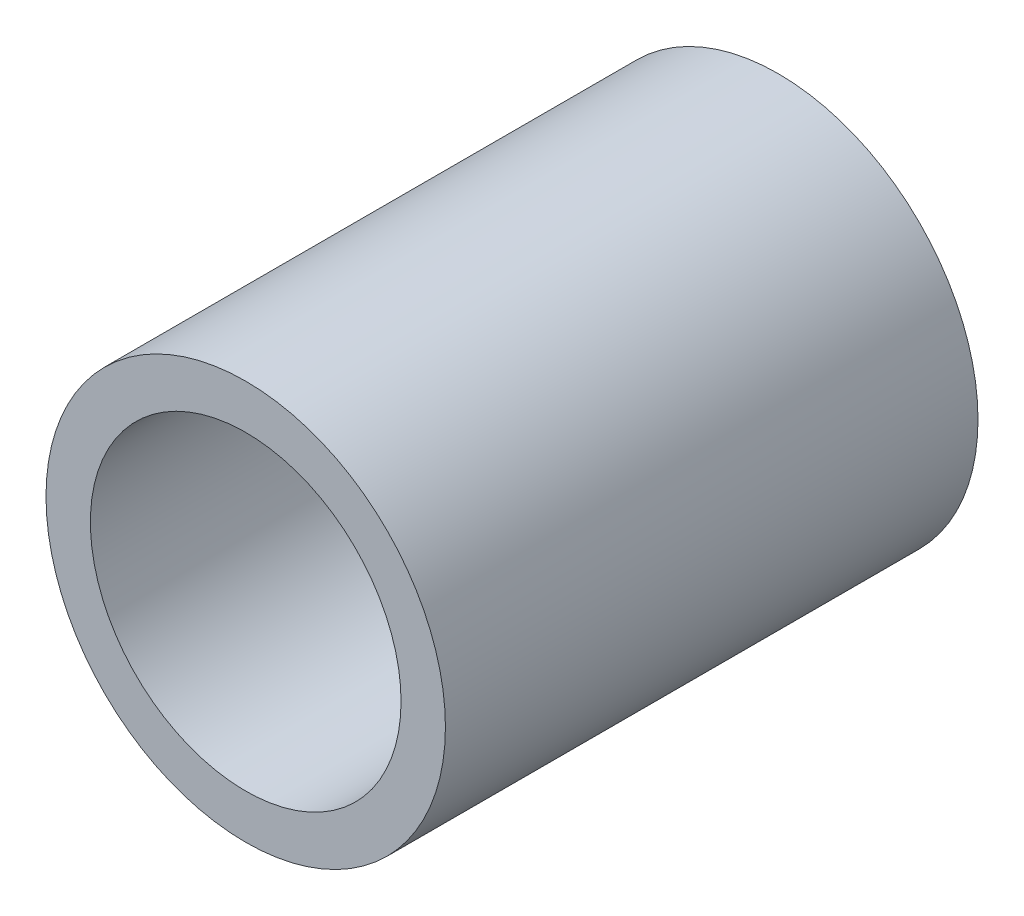
ISO-10303-21;
HEADER;
FILE_DESCRIPTION(('STEP AP214'),'2;1');
FILE_NAME('part.step','',(''),(''),'','','');
FILE_SCHEMA(('AUTOMOTIVE_DESIGN { 1 0 10303 214 1 1 1 1 }'));
ENDSEC;
DATA;
#1=APPLICATION_CONTEXT('core data for automotive mechanical design processes');
#2=APPLICATION_PROTOCOL_DEFINITION('international standard','automotive_design',2000,#1);
#3=PRODUCT_CONTEXT('',#1,'mechanical');
#4=PRODUCT('Part','Part','',(#3));
#5=PRODUCT_RELATED_PRODUCT_CATEGORY('part','',(#4));
#6=PRODUCT_DEFINITION_FORMATION('','',#4);
#7=PRODUCT_DEFINITION_CONTEXT('part definition',#1,'design');
#8=PRODUCT_DEFINITION('design','',#6,#7);
#9=PRODUCT_DEFINITION_SHAPE('','',#8);
#10=(LENGTH_UNIT() NAMED_UNIT(*) SI_UNIT(.MILLI.,.METRE.));
#11=(NAMED_UNIT(*) PLANE_ANGLE_UNIT() SI_UNIT($,.RADIAN.));
#12=(NAMED_UNIT(*) SI_UNIT($,.STERADIAN.) SOLID_ANGLE_UNIT());
#13=UNCERTAINTY_MEASURE_WITH_UNIT(LENGTH_MEASURE(1.E-05),#10,'distance_accuracy_value','');
#14=(GEOMETRIC_REPRESENTATION_CONTEXT(3) GLOBAL_UNCERTAINTY_ASSIGNED_CONTEXT((#13)) GLOBAL_UNIT_ASSIGNED_CONTEXT((#10,
#11,#12)) REPRESENTATION_CONTEXT('',''));
#15=CARTESIAN_POINT('',(0.,0.,0.));
#16=DIRECTION('',(0.,0.,1.));
#17=DIRECTION('',(1.,0.,0.));
#18=AXIS2_PLACEMENT_3D('',#15,#16,#17);
#19=CARTESIAN_POINT('',(0.,0.,12.));
#20=DIRECTION('',(0.,0.,-1.));
#21=DIRECTION('',(-1.,0.,0.));
#22=AXIS2_PLACEMENT_3D('',#19,#20,#21);
#23=CYLINDRICAL_SURFACE('',#22,4.5);
#24=CARTESIAN_POINT('',(0.,0.,12.));
#25=DIRECTION('',(0.,0.,1.));
#26=DIRECTION('',(1.,0.,0.));
#27=AXIS2_PLACEMENT_3D('',#24,#25,#26);
#28=CIRCLE('',#27,4.5);
#29=CARTESIAN_POINT('',(4.5,0.,12.));
#30=VERTEX_POINT('',#29);
#31=EDGE_CURVE('E10',#30,#30,#28,.T.);
#32=ORIENTED_EDGE('',*,*,#31,.F.);
#33=EDGE_LOOP('',(#32));
#34=FACE_BOUND('',#33,.T.);
#35=CARTESIAN_POINT('',(0.,0.,0.));
#36=DIRECTION('',(0.,0.,1.));
#37=DIRECTION('',(1.,0.,0.));
#38=AXIS2_PLACEMENT_3D('',#35,#36,#37);
#39=CIRCLE('',#38,4.5);
#40=CARTESIAN_POINT('',(4.5,0.,0.));
#41=VERTEX_POINT('',#40);
#42=EDGE_CURVE('E40',#41,#41,#39,.T.);
#43=ORIENTED_EDGE('',*,*,#42,.T.);
#44=EDGE_LOOP('',(#43));
#45=FACE_BOUND('',#44,.T.);
#46=ADVANCED_FACE('F37',(#34,#45),#23,.T.);
#47=CARTESIAN_POINT('',(0.,0.,12.));
#48=DIRECTION('',(0.,0.,1.));
#49=DIRECTION('',(1.,0.,0.));
#50=AXIS2_PLACEMENT_3D('',#47,#48,#49);
#51=PLANE('',#50);
#52=CARTESIAN_POINT('',(0.,0.,12.));
#53=DIRECTION('',(0.,0.,1.));
#54=DIRECTION('',(1.,0.,0.));
#55=AXIS2_PLACEMENT_3D('',#52,#53,#54);
#56=CIRCLE('',#55,3.5);
#57=CARTESIAN_POINT('',(3.5,0.,12.));
#58=VERTEX_POINT('',#57);
#59=EDGE_CURVE('E47',#58,#58,#56,.T.);
#60=ORIENTED_EDGE('',*,*,#59,.F.);
#61=EDGE_LOOP('',(#60));
#62=FACE_BOUND('',#61,.T.);
#63=ORIENTED_EDGE('',*,*,#31,.T.);
#64=EDGE_LOOP('',(#63));
#65=FACE_BOUND('',#64,.T.);
#66=ADVANCED_FACE('F58',(#62,#65),#51,.T.);
#67=CARTESIAN_POINT('',(0.,0.,0.));
#68=DIRECTION('',(0.,0.,1.));
#69=DIRECTION('',(1.,0.,0.));
#70=AXIS2_PLACEMENT_3D('',#67,#68,#69);
#71=PLANE('',#70);
#72=CARTESIAN_POINT('',(0.,0.,0.));
#73=DIRECTION('',(0.,0.,1.));
#74=DIRECTION('',(1.,0.,0.));
#75=AXIS2_PLACEMENT_3D('',#72,#73,#74);
#76=CIRCLE('',#75,3.5);
#77=CARTESIAN_POINT('',(3.5,0.,0.));
#78=VERTEX_POINT('',#77);
#79=EDGE_CURVE('E49',#78,#78,#76,.T.);
#80=ORIENTED_EDGE('',*,*,#79,.T.);
#81=EDGE_LOOP('',(#80));
#82=FACE_BOUND('',#81,.T.);
#83=ORIENTED_EDGE('',*,*,#42,.F.);
#84=EDGE_LOOP('',(#83));
#85=FACE_BOUND('',#84,.T.);
#86=ADVANCED_FACE('F60',(#82,#85),#71,.F.);
#87=CARTESIAN_POINT('',(0.,0.,12.));
#88=DIRECTION('',(0.,0.,-1.));
#89=DIRECTION('',(-1.,0.,0.));
#90=AXIS2_PLACEMENT_3D('',#87,#88,#89);
#91=CYLINDRICAL_SURFACE('',#90,3.5);
#92=ORIENTED_EDGE('',*,*,#59,.T.);
#93=EDGE_LOOP('',(#92));
#94=FACE_BOUND('',#93,.T.);
#95=ORIENTED_EDGE('',*,*,#79,.F.);
#96=EDGE_LOOP('',(#95));
#97=FACE_BOUND('',#96,.T.);
#98=ADVANCED_FACE('F55',(#94,#97),#91,.F.);
#99=CLOSED_SHELL('',(#46,#66,#86,#98));
#100=MANIFOLD_SOLID_BREP('B2',#99);
#101=ADVANCED_BREP_SHAPE_REPRESENTATION('',(#18,#100),#14);
#102=SHAPE_DEFINITION_REPRESENTATION(#9,#101);
ENDSEC;
END-ISO-10303-21;
